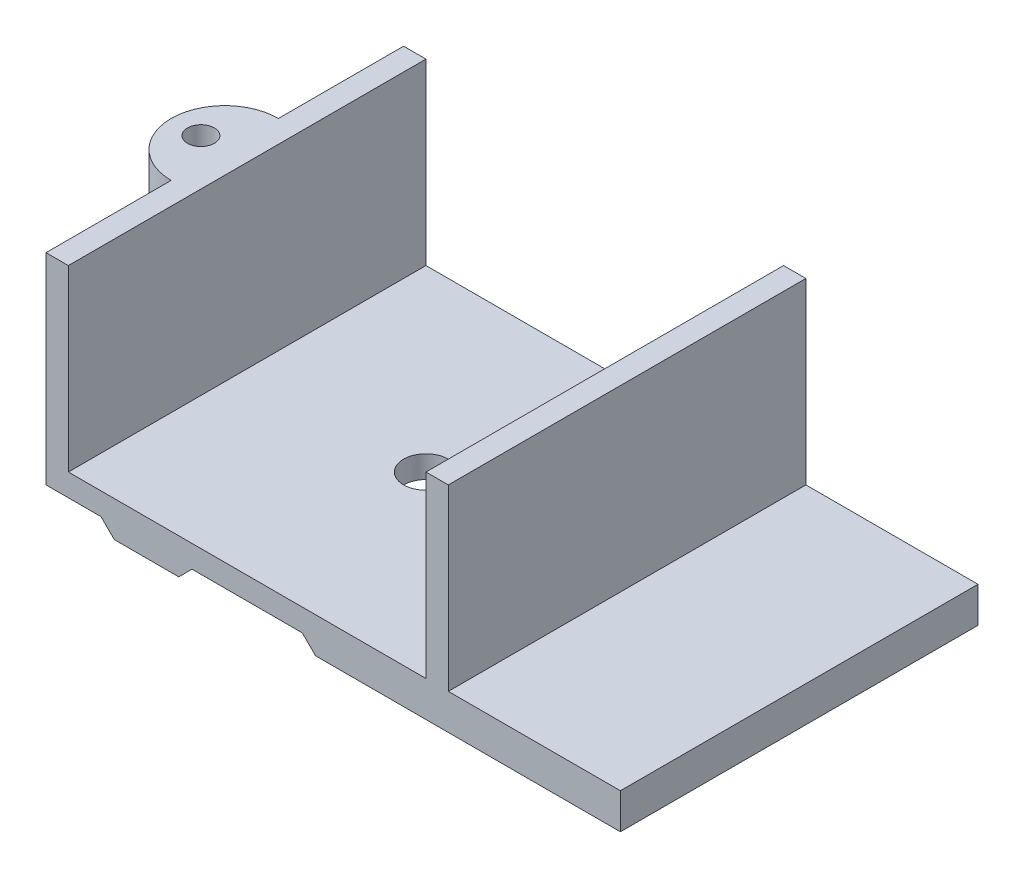
ISO-10303-21;
HEADER;
FILE_DESCRIPTION(('STEP AP214'),'2;1');
FILE_NAME('part.step','',(''),(''),'','','');
FILE_SCHEMA(('AUTOMOTIVE_DESIGN { 1 0 10303 214 1 1 1 1 }'));
ENDSEC;
DATA;
#1=APPLICATION_CONTEXT('core data for automotive mechanical design processes');
#2=APPLICATION_PROTOCOL_DEFINITION('international standard','automotive_design',2000,#1);
#3=PRODUCT_CONTEXT('',#1,'mechanical');
#4=PRODUCT('Part','Part','',(#3));
#5=PRODUCT_RELATED_PRODUCT_CATEGORY('part','',(#4));
#6=PRODUCT_DEFINITION_FORMATION('','',#4);
#7=PRODUCT_DEFINITION_CONTEXT('part definition',#1,'design');
#8=PRODUCT_DEFINITION('design','',#6,#7);
#9=PRODUCT_DEFINITION_SHAPE('','',#8);
#10=(LENGTH_UNIT() NAMED_UNIT(*) SI_UNIT(.MILLI.,.METRE.));
#11=(NAMED_UNIT(*) PLANE_ANGLE_UNIT() SI_UNIT($,.RADIAN.));
#12=(NAMED_UNIT(*) SI_UNIT($,.STERADIAN.) SOLID_ANGLE_UNIT());
#13=UNCERTAINTY_MEASURE_WITH_UNIT(LENGTH_MEASURE(1.E-05),#10,'distance_accuracy_value','');
#14=(GEOMETRIC_REPRESENTATION_CONTEXT(3) GLOBAL_UNCERTAINTY_ASSIGNED_CONTEXT((#13)) GLOBAL_UNIT_ASSIGNED_CONTEXT((#10,
#11,#12)) REPRESENTATION_CONTEXT('',''));
#15=CARTESIAN_POINT('',(0.,0.,0.));
#16=DIRECTION('',(0.,0.,1.));
#17=DIRECTION('',(1.,0.,0.));
#18=AXIS2_PLACEMENT_3D('',#15,#16,#17);
#19=CARTESIAN_POINT('',(-5.,0.,80.));
#20=DIRECTION('',(-1.,0.,0.));
#21=DIRECTION('',(0.,-1.,0.));
#22=AXIS2_PLACEMENT_3D('',#19,#20,#21);
#23=PLANE('',#22);
#24=DIRECTION('',(0.,1.,0.));
#25=VECTOR('',#24,1.);
#26=CARTESIAN_POINT('',(-4.9999999999999,-31.8328157299975,52.));
#27=LINE('',#26,#25);
#28=CARTESIAN_POINT('',(-4.99999999999994,-5.,52.));
#29=VERTEX_POINT('',#28);
#30=CARTESIAN_POINT('',(-5.,40.,52.));
#31=VERTEX_POINT('',#30);
#32=EDGE_CURVE('E315',#29,#31,#27,.T.);
#33=ORIENTED_EDGE('',*,*,#32,.F.);
#34=DIRECTION('',(0.,0.,-1.));
#35=VECTOR('',#34,1.);
#36=CARTESIAN_POINT('',(-5.,-5.,80.));
#37=LINE('',#36,#35);
#38=CARTESIAN_POINT('',(-5.,-5.,80.));
#39=VERTEX_POINT('',#38);
#40=EDGE_CURVE('E230',#39,#29,#37,.T.);
#41=ORIENTED_EDGE('',*,*,#40,.F.);
#42=DIRECTION('',(0.,1.,0.));
#43=VECTOR('',#42,1.);
#44=CARTESIAN_POINT('',(-5.,0.,80.));
#45=LINE('',#44,#43);
#46=CARTESIAN_POINT('',(-5.,40.,80.));
#47=VERTEX_POINT('',#46);
#48=EDGE_CURVE('E324',#39,#47,#45,.T.);
#49=ORIENTED_EDGE('',*,*,#48,.T.);
#50=DIRECTION('',(0.,0.,-1.));
#51=VECTOR('',#50,1.);
#52=CARTESIAN_POINT('',(-5.,40.,80.));
#53=LINE('',#52,#51);
#54=EDGE_CURVE('E234',#47,#31,#53,.T.);
#55=ORIENTED_EDGE('',*,*,#54,.T.);
#56=EDGE_LOOP('',(#33,#41,#49,#55));
#57=FACE_BOUND('',#56,.T.);
#58=ADVANCED_FACE('F36',(#57),#23,.T.);
#59=CARTESIAN_POINT('',(0.,0.,80.));
#60=DIRECTION('',(0.,1.,0.));
#61=DIRECTION('',(-1.,0.,0.));
#62=AXIS2_PLACEMENT_3D('',#59,#60,#61);
#63=PLANE('',#62);
#64=DIRECTION('',(0.,0.,-1.));
#65=VECTOR('',#64,1.);
#66=CARTESIAN_POINT('',(80.,0.,80.));
#67=LINE('',#66,#65);
#68=CARTESIAN_POINT('',(80.,0.,80.));
#69=VERTEX_POINT('',#68);
#70=CARTESIAN_POINT('',(80.,0.,0.));
#71=VERTEX_POINT('',#70);
#72=EDGE_CURVE('E176',#69,#71,#67,.T.);
#73=ORIENTED_EDGE('',*,*,#72,.T.);
#74=DIRECTION('',(1.,0.,0.));
#75=VECTOR('',#74,1.);
#76=CARTESIAN_POINT('',(0.,0.,0.));
#77=LINE('',#76,#75);
#78=CARTESIAN_POINT('',(0.,0.,0.));
#79=VERTEX_POINT('',#78);
#80=EDGE_CURVE('E110',#79,#71,#77,.T.);
#81=ORIENTED_EDGE('',*,*,#80,.F.);
#82=DIRECTION('',(0.,0.,-1.));
#83=VECTOR('',#82,1.);
#84=CARTESIAN_POINT('',(0.,0.,80.));
#85=LINE('',#84,#83);
#86=CARTESIAN_POINT('',(0.,0.,80.));
#87=VERTEX_POINT('',#86);
#88=EDGE_CURVE('E11',#87,#79,#85,.T.);
#89=ORIENTED_EDGE('',*,*,#88,.F.);
#90=DIRECTION('',(1.,0.,0.));
#91=VECTOR('',#90,1.);
#92=CARTESIAN_POINT('',(0.,0.,80.));
#93=LINE('',#92,#91);
#94=EDGE_CURVE('E61',#87,#69,#93,.T.);
#95=ORIENTED_EDGE('',*,*,#94,.T.);
#96=EDGE_LOOP('',(#73,#81,#89,#95));
#97=FACE_BOUND('',#96,.T.);
#98=CARTESIAN_POINT('',(40.,0.,40.));
#99=DIRECTION('',(0.,1.,0.));
#100=DIRECTION('',(0.,0.,1.));
#101=AXIS2_PLACEMENT_3D('',#98,#99,#100);
#102=CIRCLE('',#101,5.);
#103=CARTESIAN_POINT('',(40.,0.,45.));
#104=VERTEX_POINT('',#103);
#105=EDGE_CURVE('E306',#104,#104,#102,.T.);
#106=ORIENTED_EDGE('',*,*,#105,.F.);
#107=EDGE_LOOP('',(#106));
#108=FACE_BOUND('',#107,.T.);
#109=ADVANCED_FACE('F38',(#97,#108),#63,.T.);
#110=CARTESIAN_POINT('',(0.,0.,80.));
#111=DIRECTION('',(-1.,0.,0.));
#112=DIRECTION('',(0.,0.,1.));
#113=AXIS2_PLACEMENT_3D('',#110,#111,#112);
#114=PLANE('',#113);
#115=DIRECTION('',(0.,1.,0.));
#116=VECTOR('',#115,1.);
#117=CARTESIAN_POINT('',(0.,0.,0.));
#118=LINE('',#117,#116);
#119=CARTESIAN_POINT('',(0.,40.,0.));
#120=VERTEX_POINT('',#119);
#121=EDGE_CURVE('E181',#79,#120,#118,.T.);
#122=ORIENTED_EDGE('',*,*,#121,.T.);
#123=DIRECTION('',(0.,0.,-1.));
#124=VECTOR('',#123,1.);
#125=CARTESIAN_POINT('',(0.,40.,80.));
#126=LINE('',#125,#124);
#127=CARTESIAN_POINT('',(0.,40.,80.));
#128=VERTEX_POINT('',#127);
#129=EDGE_CURVE('E45',#128,#120,#126,.T.);
#130=ORIENTED_EDGE('',*,*,#129,.F.);
#131=DIRECTION('',(0.,1.,0.));
#132=VECTOR('',#131,1.);
#133=CARTESIAN_POINT('',(0.,0.,80.));
#134=LINE('',#133,#132);
#135=EDGE_CURVE('E321',#87,#128,#134,.T.);
#136=ORIENTED_EDGE('',*,*,#135,.F.);
#137=ORIENTED_EDGE('',*,*,#88,.T.);
#138=EDGE_LOOP('',(#122,#130,#136,#137));
#139=FACE_BOUND('',#138,.T.);
#140=ADVANCED_FACE('F348',(#139),#114,.F.);
#141=CARTESIAN_POINT('',(0.,40.,80.));
#142=DIRECTION('',(0.,-1.,0.));
#143=DIRECTION('',(1.,0.,0.));
#144=AXIS2_PLACEMENT_3D('',#141,#142,#143);
#145=PLANE('',#144);
#146=DIRECTION('',(-1.,0.,0.));
#147=VECTOR('',#146,1.);
#148=CARTESIAN_POINT('',(0.,40.,0.));
#149=LINE('',#148,#147);
#150=CARTESIAN_POINT('',(-5.,40.,0.));
#151=VERTEX_POINT('',#150);
#152=EDGE_CURVE('E184',#120,#151,#149,.T.);
#153=ORIENTED_EDGE('',*,*,#152,.T.);
#154=CARTESIAN_POINT('',(-5.,40.,28.));
#155=VERTEX_POINT('',#154);
#156=EDGE_CURVE('E233',#155,#151,#53,.T.);
#157=ORIENTED_EDGE('',*,*,#156,.F.);
#158=CARTESIAN_POINT('',(-5.,40.,40.));
#159=DIRECTION('',(0.,1.,0.));
#160=DIRECTION('',(-1.,0.,0.));
#161=AXIS2_PLACEMENT_3D('',#158,#159,#160);
#162=CIRCLE('',#161,12.);
#163=EDGE_CURVE('E258',#155,#31,#162,.T.);
#164=ORIENTED_EDGE('',*,*,#163,.T.);
#165=ORIENTED_EDGE('',*,*,#54,.F.);
#166=DIRECTION('',(-1.,0.,0.));
#167=VECTOR('',#166,1.);
#168=CARTESIAN_POINT('',(0.,40.,80.));
#169=LINE('',#168,#167);
#170=EDGE_CURVE('E246',#128,#47,#169,.T.);
#171=ORIENTED_EDGE('',*,*,#170,.F.);
#172=ORIENTED_EDGE('',*,*,#129,.T.);
#173=EDGE_LOOP('',(#153,#157,#164,#165,#171,#172));
#174=FACE_BOUND('',#173,.T.);
#175=CARTESIAN_POINT('',(-10.3381119611959,40.,40.));
#176=DIRECTION('',(0.,1.,0.));
#177=DIRECTION('',(-1.,0.,0.));
#178=AXIS2_PLACEMENT_3D('',#175,#176,#177);
#179=CIRCLE('',#178,3.);
#180=CARTESIAN_POINT('',(-13.3381119611959,40.,40.));
#181=VERTEX_POINT('',#180);
#182=EDGE_CURVE('E311',#181,#181,#179,.T.);
#183=ORIENTED_EDGE('',*,*,#182,.F.);
#184=EDGE_LOOP('',(#183));
#185=FACE_BOUND('',#184,.T.);
#186=ADVANCED_FACE('F242',(#174,#185),#145,.F.);
#187=DIRECTION('',(0.,1.,0.));
#188=VECTOR('',#187,1.);
#189=CARTESIAN_POINT('',(-4.9999999999999,-31.8328157299975,28.));
#190=LINE('',#189,#188);
#191=CARTESIAN_POINT('',(-5.,-5.,28.));
#192=VERTEX_POINT('',#191);
#193=EDGE_CURVE('E52',#192,#155,#190,.T.);
#194=ORIENTED_EDGE('',*,*,#193,.T.);
#195=ORIENTED_EDGE('',*,*,#156,.T.);
#196=DIRECTION('',(0.,1.,0.));
#197=VECTOR('',#196,1.);
#198=CARTESIAN_POINT('',(-5.,0.,0.));
#199=LINE('',#198,#197);
#200=CARTESIAN_POINT('',(-5.,-5.,0.));
#201=VERTEX_POINT('',#200);
#202=EDGE_CURVE('E187',#201,#151,#199,.T.);
#203=ORIENTED_EDGE('',*,*,#202,.F.);
#204=EDGE_CURVE('E229',#192,#201,#37,.T.);
#205=ORIENTED_EDGE('',*,*,#204,.F.);
#206=EDGE_LOOP('',(#194,#195,#203,#205));
#207=FACE_BOUND('',#206,.T.);
#208=ADVANCED_FACE('F254',(#207),#23,.T.);
#209=CARTESIAN_POINT('',(0.,-5.,80.));
#210=DIRECTION('',(0.,1.,0.));
#211=DIRECTION('',(0.,0.,1.));
#212=AXIS2_PLACEMENT_3D('',#209,#210,#211);
#213=PLANE('',#212);
#214=DIRECTION('',(1.,0.,0.));
#215=VECTOR('',#214,1.);
#216=CARTESIAN_POINT('',(0.,-5.,0.));
#217=LINE('',#216,#215);
#218=CARTESIAN_POINT('',(7.3118099304072,-5.,0.));
#219=VERTEX_POINT('',#218);
#220=EDGE_CURVE('E190',#201,#219,#217,.T.);
#221=ORIENTED_EDGE('',*,*,#220,.T.);
#222=DIRECTION('',(0.,0.,-1.));
#223=VECTOR('',#222,1.);
#224=CARTESIAN_POINT('',(7.3118099304072,-5.,80.));
#225=LINE('',#224,#223);
#226=CARTESIAN_POINT('',(7.3118099304072,-5.,80.));
#227=VERTEX_POINT('',#226);
#228=EDGE_CURVE('E226',#227,#219,#225,.T.);
#229=ORIENTED_EDGE('',*,*,#228,.F.);
#230=DIRECTION('',(1.,0.,0.));
#231=VECTOR('',#230,1.);
#232=CARTESIAN_POINT('',(0.,-5.,80.));
#233=LINE('',#232,#231);
#234=EDGE_CURVE('E327',#39,#227,#233,.T.);
#235=ORIENTED_EDGE('',*,*,#234,.F.);
#236=ORIENTED_EDGE('',*,*,#40,.T.);
#237=CARTESIAN_POINT('',(-4.99999999999994,-5.,40.));
#238=DIRECTION('',(0.,1.,0.));
#239=DIRECTION('',(0.,0.,1.));
#240=AXIS2_PLACEMENT_3D('',#237,#238,#239);
#241=CIRCLE('',#240,12.);
#242=EDGE_CURVE('E309',#29,#192,#241,.F.);
#243=ORIENTED_EDGE('',*,*,#242,.T.);
#244=ORIENTED_EDGE('',*,*,#204,.T.);
#245=EDGE_LOOP('',(#221,#229,#235,#236,#243,#244));
#246=FACE_BOUND('',#245,.T.);
#247=CARTESIAN_POINT('',(-10.3381119611958,-5.,40.));
#248=DIRECTION('',(0.,1.,0.));
#249=DIRECTION('',(0.,0.,1.));
#250=AXIS2_PLACEMENT_3D('',#247,#248,#249);
#251=CIRCLE('',#250,3.);
#252=CARTESIAN_POINT('',(-10.3381119611958,-5.,43.));
#253=VERTEX_POINT('',#252);
#254=EDGE_CURVE('E182',#253,#253,#251,.F.);
#255=ORIENTED_EDGE('',*,*,#254,.F.);
#256=EDGE_LOOP('',(#255));
#257=FACE_BOUND('',#256,.T.);
#258=ADVANCED_FACE('F363',(#246,#257),#213,.F.);
#259=CARTESIAN_POINT('',(1.1559049652036,1.1559049652036,80.));
#260=DIRECTION('',(0.707106781186548,0.707106781186547,0.));
#261=DIRECTION('',(-0.707106781186547,0.707106781186548,0.));
#262=AXIS2_PLACEMENT_3D('',#259,#260,#261);
#263=PLANE('',#262);
#264=DIRECTION('',(0.707106781186547,-0.707106781186548,0.));
#265=VECTOR('',#264,1.);
#266=CARTESIAN_POINT('',(1.1559049652036,1.1559049652036,0.));
#267=LINE('',#266,#265);
#268=CARTESIAN_POINT('',(10.2717210446728,-7.95991111426556,0.));
#269=VERTEX_POINT('',#268);
#270=EDGE_CURVE('E192',#219,#269,#267,.T.);
#271=ORIENTED_EDGE('',*,*,#270,.T.);
#272=DIRECTION('',(0.,0.,-1.));
#273=VECTOR('',#272,1.);
#274=CARTESIAN_POINT('',(10.2717210446728,-7.95991111426556,80.));
#275=LINE('',#274,#273);
#276=CARTESIAN_POINT('',(10.2717210446728,-7.95991111426556,80.));
#277=VERTEX_POINT('',#276);
#278=EDGE_CURVE('E223',#277,#269,#275,.T.);
#279=ORIENTED_EDGE('',*,*,#278,.F.);
#280=DIRECTION('',(0.707106781186547,-0.707106781186548,0.));
#281=VECTOR('',#280,1.);
#282=CARTESIAN_POINT('',(1.1559049652036,1.1559049652036,80.));
#283=LINE('',#282,#281);
#284=EDGE_CURVE('E329',#227,#277,#283,.T.);
#285=ORIENTED_EDGE('',*,*,#284,.F.);
#286=ORIENTED_EDGE('',*,*,#228,.T.);
#287=EDGE_LOOP('',(#271,#279,#285,#286));
#288=FACE_BOUND('',#287,.T.);
#289=ADVANCED_FACE('F367',(#288),#263,.F.);
#290=CARTESIAN_POINT('',(0.,-7.95991111426556,80.));
#291=DIRECTION('',(0.,1.,0.));
#292=DIRECTION('',(0.,0.,1.));
#293=AXIS2_PLACEMENT_3D('',#290,#291,#292);
#294=PLANE('',#293);
#295=DIRECTION('',(1.,0.,0.));
#296=VECTOR('',#295,1.);
#297=CARTESIAN_POINT('',(0.,-7.95991111426556,0.));
#298=LINE('',#297,#296);
#299=CARTESIAN_POINT('',(24.7011650414248,-7.95991111426556,0.));
#300=VERTEX_POINT('',#299);
#301=EDGE_CURVE('E194',#269,#300,#298,.T.);
#302=ORIENTED_EDGE('',*,*,#301,.T.);
#303=DIRECTION('',(0.,0.,-1.));
#304=VECTOR('',#303,1.);
#305=CARTESIAN_POINT('',(24.7011650414248,-7.95991111426556,80.));
#306=LINE('',#305,#304);
#307=CARTESIAN_POINT('',(24.7011650414248,-7.95991111426556,80.));
#308=VERTEX_POINT('',#307);
#309=EDGE_CURVE('E220',#308,#300,#306,.T.);
#310=ORIENTED_EDGE('',*,*,#309,.F.);
#311=DIRECTION('',(1.,0.,0.));
#312=VECTOR('',#311,1.);
#313=CARTESIAN_POINT('',(0.,-7.95991111426556,80.));
#314=LINE('',#313,#312);
#315=EDGE_CURVE('E331',#277,#308,#314,.T.);
#316=ORIENTED_EDGE('',*,*,#315,.F.);
#317=ORIENTED_EDGE('',*,*,#278,.T.);
#318=EDGE_LOOP('',(#302,#310,#316,#317));
#319=FACE_BOUND('',#318,.T.);
#320=ADVANCED_FACE('F372',(#319),#294,.F.);
#321=CARTESIAN_POINT('',(16.3305380778452,-16.3305380778452,80.));
#322=DIRECTION('',(-0.707106781186548,0.707106781186548,0.));
#323=DIRECTION('',(-0.707106781186548,-0.707106781186548,0.));
#324=AXIS2_PLACEMENT_3D('',#321,#322,#323);
#325=PLANE('',#324);
#326=DIRECTION('',(0.707106781186548,0.707106781186548,0.));
#327=VECTOR('',#326,1.);
#328=CARTESIAN_POINT('',(16.3305380778452,-16.3305380778452,0.));
#329=LINE('',#328,#327);
#330=CARTESIAN_POINT('',(27.6610761556903,-5.,0.));
#331=VERTEX_POINT('',#330);
#332=EDGE_CURVE('E196',#300,#331,#329,.T.);
#333=ORIENTED_EDGE('',*,*,#332,.T.);
#334=DIRECTION('',(0.,0.,-1.));
#335=VECTOR('',#334,1.);
#336=CARTESIAN_POINT('',(27.6610761556903,-5.,80.));
#337=LINE('',#336,#335);
#338=CARTESIAN_POINT('',(27.6610761556903,-5.,80.));
#339=VERTEX_POINT('',#338);
#340=EDGE_CURVE('E217',#339,#331,#337,.T.);
#341=ORIENTED_EDGE('',*,*,#340,.F.);
#342=DIRECTION('',(0.707106781186548,0.707106781186548,0.));
#343=VECTOR('',#342,1.);
#344=CARTESIAN_POINT('',(16.3305380778452,-16.3305380778452,80.));
#345=LINE('',#344,#343);
#346=EDGE_CURVE('E333',#308,#339,#345,.T.);
#347=ORIENTED_EDGE('',*,*,#346,.F.);
#348=ORIENTED_EDGE('',*,*,#309,.T.);
#349=EDGE_LOOP('',(#333,#341,#347,#348));
#350=FACE_BOUND('',#349,.T.);
#351=ADVANCED_FACE('F379',(#350),#325,.F.);
#352=CARTESIAN_POINT('',(0.,-5.,80.));
#353=DIRECTION('',(0.,1.,0.));
#354=DIRECTION('',(0.,0.,1.));
#355=AXIS2_PLACEMENT_3D('',#352,#353,#354);
#356=PLANE('',#355);
#357=CARTESIAN_POINT('',(40.,-5.,40.));
#358=DIRECTION('',(0.,1.,0.));
#359=DIRECTION('',(0.,0.,1.));
#360=AXIS2_PLACEMENT_3D('',#357,#358,#359);
#361=CIRCLE('',#360,5.);
#362=CARTESIAN_POINT('',(40.,-5.,45.));
#363=VERTEX_POINT('',#362);
#364=EDGE_CURVE('E40',#363,#363,#361,.T.);
#365=ORIENTED_EDGE('',*,*,#364,.T.);
#366=EDGE_LOOP('',(#365));
#367=FACE_BOUND('',#366,.T.);
#368=DIRECTION('',(1.,0.,0.));
#369=VECTOR('',#368,1.);
#370=CARTESIAN_POINT('',(0.,-5.,0.));
#371=LINE('',#370,#369);
#372=CARTESIAN_POINT('',(52.3389238443097,-5.,0.));
#373=VERTEX_POINT('',#372);
#374=EDGE_CURVE('E198',#331,#373,#371,.T.);
#375=ORIENTED_EDGE('',*,*,#374,.T.);
#376=DIRECTION('',(0.,0.,-1.));
#377=VECTOR('',#376,1.);
#378=CARTESIAN_POINT('',(52.3389238443097,-5.,80.));
#379=LINE('',#378,#377);
#380=CARTESIAN_POINT('',(52.3389238443097,-5.,80.));
#381=VERTEX_POINT('',#380);
#382=EDGE_CURVE('E215',#381,#373,#379,.T.);
#383=ORIENTED_EDGE('',*,*,#382,.F.);
#384=DIRECTION('',(1.,0.,0.));
#385=VECTOR('',#384,1.);
#386=CARTESIAN_POINT('',(0.,-5.,80.));
#387=LINE('',#386,#385);
#388=EDGE_CURVE('E335',#339,#381,#387,.T.);
#389=ORIENTED_EDGE('',*,*,#388,.F.);
#390=ORIENTED_EDGE('',*,*,#340,.T.);
#391=EDGE_LOOP('',(#375,#383,#389,#390));
#392=FACE_BOUND('',#391,.T.);
#393=ADVANCED_FACE('F383',(#367,#392),#356,.F.);
#394=CARTESIAN_POINT('',(23.6694619221549,23.6694619221548,80.));
#395=DIRECTION('',(-0.707106781186548,-0.707106781186547,0.));
#396=DIRECTION('',(0.707106781186547,-0.707106781186548,0.));
#397=AXIS2_PLACEMENT_3D('',#394,#395,#396);
#398=PLANE('',#397);
#399=DIRECTION('',(-0.707106781186547,0.707106781186548,0.));
#400=VECTOR('',#399,1.);
#401=CARTESIAN_POINT('',(23.6694619221549,23.6694619221548,0.));
#402=LINE('',#401,#400);
#403=CARTESIAN_POINT('',(55.2988349585752,-7.95991111426556,0.));
#404=VERTEX_POINT('',#403);
#405=EDGE_CURVE('E201',#404,#373,#402,.T.);
#406=ORIENTED_EDGE('',*,*,#405,.F.);
#407=DIRECTION('',(0.,0.,-1.));
#408=VECTOR('',#407,1.);
#409=CARTESIAN_POINT('',(55.2988349585752,-7.95991111426556,80.));
#410=LINE('',#409,#408);
#411=CARTESIAN_POINT('',(55.2988349585752,-7.95991111426556,80.));
#412=VERTEX_POINT('',#411);
#413=EDGE_CURVE('E170',#412,#404,#410,.T.);
#414=ORIENTED_EDGE('',*,*,#413,.F.);
#415=DIRECTION('',(-0.707106781186547,0.707106781186548,0.));
#416=VECTOR('',#415,1.);
#417=CARTESIAN_POINT('',(23.6694619221549,23.6694619221548,80.));
#418=LINE('',#417,#416);
#419=EDGE_CURVE('E282',#412,#381,#418,.T.);
#420=ORIENTED_EDGE('',*,*,#419,.T.);
#421=ORIENTED_EDGE('',*,*,#382,.T.);
#422=EDGE_LOOP('',(#406,#414,#420,#421));
#423=FACE_BOUND('',#422,.T.);
#424=ADVANCED_FACE('F339',(#423),#398,.T.);
#425=CARTESIAN_POINT('',(0.,-7.95991111426556,80.));
#426=DIRECTION('',(0.,-1.,0.));
#427=DIRECTION('',(0.,0.,-1.));
#428=AXIS2_PLACEMENT_3D('',#425,#426,#427);
#429=PLANE('',#428);
#430=DIRECTION('',(-1.,0.,0.));
#431=VECTOR('',#430,1.);
#432=CARTESIAN_POINT('',(0.,-7.95991111426556,0.));
#433=LINE('',#432,#431);
#434=CARTESIAN_POINT('',(123.5,-7.95991111426555,0.));
#435=VERTEX_POINT('',#434);
#436=EDGE_CURVE('E204',#435,#404,#433,.T.);
#437=ORIENTED_EDGE('',*,*,#436,.F.);
#438=DIRECTION('',(0.,0.,-1.));
#439=VECTOR('',#438,1.);
#440=CARTESIAN_POINT('',(123.5,-7.95991111426555,80.));
#441=LINE('',#440,#439);
#442=CARTESIAN_POINT('',(123.5,-7.95991111426555,80.));
#443=VERTEX_POINT('',#442);
#444=EDGE_CURVE('E290',#443,#435,#441,.T.);
#445=ORIENTED_EDGE('',*,*,#444,.F.);
#446=DIRECTION('',(-1.,0.,0.));
#447=VECTOR('',#446,1.);
#448=CARTESIAN_POINT('',(0.,-7.95991111426556,80.));
#449=LINE('',#448,#447);
#450=EDGE_CURVE('E160',#443,#412,#449,.T.);
#451=ORIENTED_EDGE('',*,*,#450,.T.);
#452=ORIENTED_EDGE('',*,*,#413,.T.);
#453=EDGE_LOOP('',(#437,#445,#451,#452));
#454=FACE_BOUND('',#453,.T.);
#455=ADVANCED_FACE('F295',(#454),#429,.T.);
#456=CARTESIAN_POINT('',(85.,0.,80.));
#457=DIRECTION('',(-1.,0.,0.));
#458=DIRECTION('',(0.,0.,1.));
#459=AXIS2_PLACEMENT_3D('',#456,#457,#458);
#460=PLANE('',#459);
#461=DIRECTION('',(0.,1.,0.));
#462=VECTOR('',#461,1.);
#463=CARTESIAN_POINT('',(85.,0.,80.));
#464=LINE('',#463,#462);
#465=CARTESIAN_POINT('',(85.,0.,80.));
#466=VERTEX_POINT('',#465);
#467=CARTESIAN_POINT('',(85.,40.,80.));
#468=VERTEX_POINT('',#467);
#469=EDGE_CURVE('E147',#466,#468,#464,.T.);
#470=ORIENTED_EDGE('',*,*,#469,.F.);
#471=DIRECTION('',(0.,0.,-1.));
#472=VECTOR('',#471,1.);
#473=CARTESIAN_POINT('',(85.,0.,80.));
#474=LINE('',#473,#472);
#475=CARTESIAN_POINT('',(85.,0.,0.));
#476=VERTEX_POINT('',#475);
#477=EDGE_CURVE('E303',#466,#476,#474,.T.);
#478=ORIENTED_EDGE('',*,*,#477,.T.);
#479=DIRECTION('',(0.,1.,0.));
#480=VECTOR('',#479,1.);
#481=CARTESIAN_POINT('',(85.,0.,0.));
#482=LINE('',#481,#480);
#483=CARTESIAN_POINT('',(85.,40.,0.));
#484=VERTEX_POINT('',#483);
#485=EDGE_CURVE('E166',#476,#484,#482,.T.);
#486=ORIENTED_EDGE('',*,*,#485,.T.);
#487=DIRECTION('',(0.,0.,-1.));
#488=VECTOR('',#487,1.);
#489=CARTESIAN_POINT('',(85.,40.,80.));
#490=LINE('',#489,#488);
#491=EDGE_CURVE('E163',#468,#484,#490,.T.);
#492=ORIENTED_EDGE('',*,*,#491,.F.);
#493=EDGE_LOOP('',(#470,#478,#486,#492));
#494=FACE_BOUND('',#493,.T.);
#495=ADVANCED_FACE('F164',(#494),#460,.F.);
#496=CARTESIAN_POINT('',(0.,40.0000000000001,80.));
#497=DIRECTION('',(0.,1.,0.));
#498=DIRECTION('',(-1.,0.,0.));
#499=AXIS2_PLACEMENT_3D('',#496,#497,#498);
#500=PLANE('',#499);
#501=DIRECTION('',(1.,0.,0.));
#502=VECTOR('',#501,1.);
#503=CARTESIAN_POINT('',(0.,40.0000000000001,0.));
#504=LINE('',#503,#502);
#505=CARTESIAN_POINT('',(80.,40.,0.));
#506=VERTEX_POINT('',#505);
#507=EDGE_CURVE('E208',#506,#484,#504,.T.);
#508=ORIENTED_EDGE('',*,*,#507,.F.);
#509=DIRECTION('',(0.,0.,-1.));
#510=VECTOR('',#509,1.);
#511=CARTESIAN_POINT('',(80.,40.,80.));
#512=LINE('',#511,#510);
#513=CARTESIAN_POINT('',(80.,40.,80.));
#514=VERTEX_POINT('',#513);
#515=EDGE_CURVE('E171',#514,#506,#512,.T.);
#516=ORIENTED_EDGE('',*,*,#515,.F.);
#517=DIRECTION('',(1.,0.,0.));
#518=VECTOR('',#517,1.);
#519=CARTESIAN_POINT('',(0.,40.0000000000001,80.));
#520=LINE('',#519,#518);
#521=EDGE_CURVE('E152',#514,#468,#520,.T.);
#522=ORIENTED_EDGE('',*,*,#521,.T.);
#523=ORIENTED_EDGE('',*,*,#491,.T.);
#524=EDGE_LOOP('',(#508,#516,#522,#523));
#525=FACE_BOUND('',#524,.T.);
#526=ADVANCED_FACE('F173',(#525),#500,.T.);
#527=CARTESIAN_POINT('',(80.,0.,80.));
#528=DIRECTION('',(-1.,0.,0.));
#529=DIRECTION('',(0.,0.,1.));
#530=AXIS2_PLACEMENT_3D('',#527,#528,#529);
#531=PLANE('',#530);
#532=DIRECTION('',(0.,1.,0.));
#533=VECTOR('',#532,1.);
#534=CARTESIAN_POINT('',(80.,0.,0.));
#535=LINE('',#534,#533);
#536=EDGE_CURVE('E210',#71,#506,#535,.T.);
#537=ORIENTED_EDGE('',*,*,#536,.F.);
#538=ORIENTED_EDGE('',*,*,#72,.F.);
#539=DIRECTION('',(0.,1.,0.));
#540=VECTOR('',#539,1.);
#541=CARTESIAN_POINT('',(80.,0.,80.));
#542=LINE('',#541,#540);
#543=EDGE_CURVE('E174',#69,#514,#542,.T.);
#544=ORIENTED_EDGE('',*,*,#543,.T.);
#545=ORIENTED_EDGE('',*,*,#515,.T.);
#546=EDGE_LOOP('',(#537,#538,#544,#545));
#547=FACE_BOUND('',#546,.T.);
#548=ADVANCED_FACE('F346',(#547),#531,.T.);
#549=CARTESIAN_POINT('',(0.,0.,80.));
#550=DIRECTION('',(0.,0.,1.));
#551=DIRECTION('',(1.,0.,0.));
#552=AXIS2_PLACEMENT_3D('',#549,#550,#551);
#553=PLANE('',#552);
#554=DIRECTION('',(1.,0.,0.));
#555=VECTOR('',#554,1.);
#556=CARTESIAN_POINT('',(-23.337146391205,0.,80.));
#557=LINE('',#556,#555);
#558=CARTESIAN_POINT('',(123.5,0.,80.));
#559=VERTEX_POINT('',#558);
#560=EDGE_CURVE('E157',#466,#559,#557,.T.);
#561=ORIENTED_EDGE('',*,*,#560,.F.);
#562=ORIENTED_EDGE('',*,*,#469,.T.);
#563=ORIENTED_EDGE('',*,*,#521,.F.);
#564=ORIENTED_EDGE('',*,*,#543,.F.);
#565=ORIENTED_EDGE('',*,*,#94,.F.);
#566=ORIENTED_EDGE('',*,*,#135,.T.);
#567=ORIENTED_EDGE('',*,*,#170,.T.);
#568=ORIENTED_EDGE('',*,*,#48,.F.);
#569=ORIENTED_EDGE('',*,*,#234,.T.);
#570=ORIENTED_EDGE('',*,*,#284,.T.);
#571=ORIENTED_EDGE('',*,*,#315,.T.);
#572=ORIENTED_EDGE('',*,*,#346,.T.);
#573=ORIENTED_EDGE('',*,*,#388,.T.);
#574=ORIENTED_EDGE('',*,*,#419,.F.);
#575=ORIENTED_EDGE('',*,*,#450,.F.);
#576=DIRECTION('',(0.,-1.,0.));
#577=VECTOR('',#576,1.);
#578=CARTESIAN_POINT('',(123.5,-5.,80.));
#579=LINE('',#578,#577);
#580=EDGE_CURVE('E280',#559,#443,#579,.T.);
#581=ORIENTED_EDGE('',*,*,#580,.F.);
#582=EDGE_LOOP('',(#561,#562,#563,#564,#565,#566,#567,#568,#569,#570,#571,#572,#573,#574,#575,#581));
#583=FACE_BOUND('',#582,.T.);
#584=ADVANCED_FACE('F149',(#583),#553,.T.);
#585=CARTESIAN_POINT('',(0.,0.,0.));
#586=DIRECTION('',(0.,0.,1.));
#587=DIRECTION('',(1.,0.,0.));
#588=AXIS2_PLACEMENT_3D('',#585,#586,#587);
#589=PLANE('',#588);
#590=ORIENTED_EDGE('',*,*,#485,.F.);
#591=DIRECTION('',(1.,0.,0.));
#592=VECTOR('',#591,1.);
#593=CARTESIAN_POINT('',(-23.337146391205,0.,0.));
#594=LINE('',#593,#592);
#595=CARTESIAN_POINT('',(123.5,0.,0.));
#596=VERTEX_POINT('',#595);
#597=EDGE_CURVE('E301',#476,#596,#594,.T.);
#598=ORIENTED_EDGE('',*,*,#597,.T.);
#599=DIRECTION('',(0.,1.,0.));
#600=VECTOR('',#599,1.);
#601=CARTESIAN_POINT('',(123.5,-5.,0.));
#602=LINE('',#601,#600);
#603=EDGE_CURVE('E296',#435,#596,#602,.T.);
#604=ORIENTED_EDGE('',*,*,#603,.F.);
#605=ORIENTED_EDGE('',*,*,#436,.T.);
#606=ORIENTED_EDGE('',*,*,#405,.T.);
#607=ORIENTED_EDGE('',*,*,#374,.F.);
#608=ORIENTED_EDGE('',*,*,#332,.F.);
#609=ORIENTED_EDGE('',*,*,#301,.F.);
#610=ORIENTED_EDGE('',*,*,#270,.F.);
#611=ORIENTED_EDGE('',*,*,#220,.F.);
#612=ORIENTED_EDGE('',*,*,#202,.T.);
#613=ORIENTED_EDGE('',*,*,#152,.F.);
#614=ORIENTED_EDGE('',*,*,#121,.F.);
#615=ORIENTED_EDGE('',*,*,#80,.T.);
#616=ORIENTED_EDGE('',*,*,#536,.T.);
#617=ORIENTED_EDGE('',*,*,#507,.T.);
#618=EDGE_LOOP('',(#590,#598,#604,#605,#606,#607,#608,#609,#610,#611,#612,#613,#614,#615,#616,#617));
#619=FACE_BOUND('',#618,.T.);
#620=ADVANCED_FACE('F248',(#619),#589,.F.);
#621=CARTESIAN_POINT('',(-4.9999999999999,-31.8328157299975,40.));
#622=DIRECTION('',(0.,1.,0.));
#623=DIRECTION('',(-1.,0.,0.));
#624=AXIS2_PLACEMENT_3D('',#621,#622,#623);
#625=CYLINDRICAL_SURFACE('',#624,12.);
#626=ORIENTED_EDGE('',*,*,#242,.F.);
#627=ORIENTED_EDGE('',*,*,#32,.T.);
#628=ORIENTED_EDGE('',*,*,#163,.F.);
#629=ORIENTED_EDGE('',*,*,#193,.F.);
#630=EDGE_LOOP('',(#626,#627,#628,#629));
#631=FACE_BOUND('',#630,.T.);
#632=ADVANCED_FACE('F400',(#631),#625,.T.);
#633=CARTESIAN_POINT('',(-10.3381119611958,-31.8328157299975,40.));
#634=DIRECTION('',(0.,1.,0.));
#635=DIRECTION('',(-1.,0.,0.));
#636=AXIS2_PLACEMENT_3D('',#633,#634,#635);
#637=CYLINDRICAL_SURFACE('',#636,3.);
#638=ORIENTED_EDGE('',*,*,#254,.T.);
#639=EDGE_LOOP('',(#638));
#640=FACE_BOUND('',#639,.T.);
#641=ORIENTED_EDGE('',*,*,#182,.T.);
#642=EDGE_LOOP('',(#641));
#643=FACE_BOUND('',#642,.T.);
#644=ADVANCED_FACE('F405',(#640,#643),#637,.F.);
#645=CARTESIAN_POINT('',(40.,-7.95991111426556,40.));
#646=DIRECTION('',(0.,1.,0.));
#647=DIRECTION('',(0.,0.,1.));
#648=AXIS2_PLACEMENT_3D('',#645,#646,#647);
#649=CYLINDRICAL_SURFACE('',#648,5.);
#650=ORIENTED_EDGE('',*,*,#105,.T.);
#651=EDGE_LOOP('',(#650));
#652=FACE_BOUND('',#651,.T.);
#653=ORIENTED_EDGE('',*,*,#364,.F.);
#654=EDGE_LOOP('',(#653));
#655=FACE_BOUND('',#654,.T.);
#656=ADVANCED_FACE('F408',(#652,#655),#649,.F.);
#657=CARTESIAN_POINT('',(-23.337146391205,0.,80.));
#658=DIRECTION('',(0.,1.,0.));
#659=DIRECTION('',(0.,0.,1.));
#660=AXIS2_PLACEMENT_3D('',#657,#658,#659);
#661=PLANE('',#660);
#662=ORIENTED_EDGE('',*,*,#477,.F.);
#663=ORIENTED_EDGE('',*,*,#560,.T.);
#664=DIRECTION('',(0.,0.,1.));
#665=VECTOR('',#664,1.);
#666=CARTESIAN_POINT('',(123.5,0.,80.));
#667=LINE('',#666,#665);
#668=EDGE_CURVE('E293',#596,#559,#667,.T.);
#669=ORIENTED_EDGE('',*,*,#668,.F.);
#670=ORIENTED_EDGE('',*,*,#597,.F.);
#671=EDGE_LOOP('',(#662,#663,#669,#670));
#672=FACE_BOUND('',#671,.T.);
#673=ADVANCED_FACE('F343',(#672),#661,.T.);
#674=CARTESIAN_POINT('',(123.5,0.,0.));
#675=DIRECTION('',(-1.,0.,0.));
#676=DIRECTION('',(0.,0.,1.));
#677=AXIS2_PLACEMENT_3D('',#674,#675,#676);
#678=PLANE('',#677);
#679=ORIENTED_EDGE('',*,*,#580,.T.);
#680=ORIENTED_EDGE('',*,*,#444,.T.);
#681=ORIENTED_EDGE('',*,*,#603,.T.);
#682=ORIENTED_EDGE('',*,*,#668,.T.);
#683=EDGE_LOOP('',(#679,#680,#681,#682));
#684=FACE_BOUND('',#683,.T.);
#685=ADVANCED_FACE('F288',(#684),#678,.F.);
#686=CLOSED_SHELL('',(#58,#109,#140,#186,#208,#258,#289,#320,#351,#393,#424,#455,#495,#526,#548,
#584,#620,#632,#644,#656,#673,#685));
#687=MANIFOLD_SOLID_BREP('B2',#686);
#688=ADVANCED_BREP_SHAPE_REPRESENTATION('',(#18,#687),#14);
#689=SHAPE_DEFINITION_REPRESENTATION(#9,#688);
ENDSEC;
END-ISO-10303-21;
